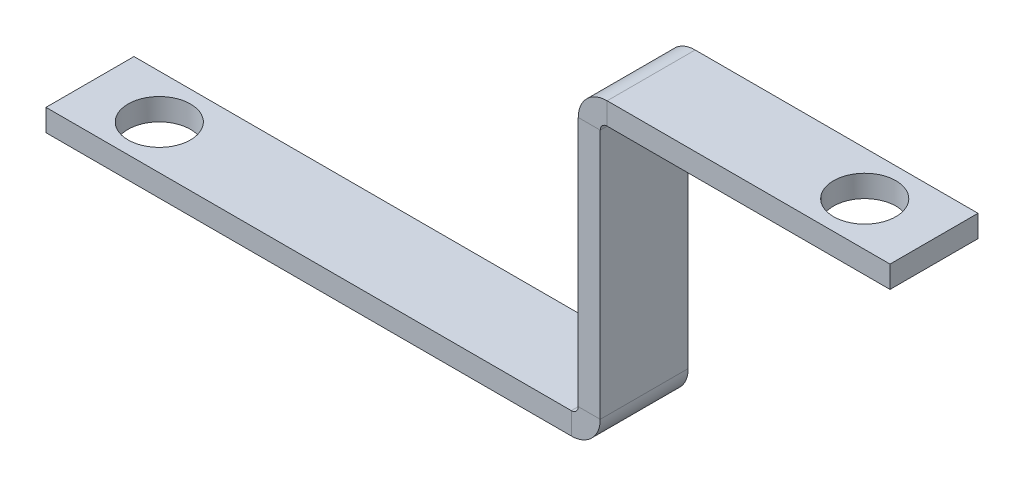
ISO-10303-21;
HEADER;
FILE_DESCRIPTION(('STEP AP214'),'2;1');
FILE_NAME('part.step','',(''),(''),'','','');
FILE_SCHEMA(('AUTOMOTIVE_DESIGN { 1 0 10303 214 1 1 1 1 }'));
ENDSEC;
DATA;
#1=APPLICATION_CONTEXT('core data for automotive mechanical design processes');
#2=APPLICATION_PROTOCOL_DEFINITION('international standard','automotive_design',2000,#1);
#3=PRODUCT_CONTEXT('',#1,'mechanical');
#4=PRODUCT('Part','Part','',(#3));
#5=PRODUCT_RELATED_PRODUCT_CATEGORY('part','',(#4));
#6=PRODUCT_DEFINITION_FORMATION('','',#4);
#7=PRODUCT_DEFINITION_CONTEXT('part definition',#1,'design');
#8=PRODUCT_DEFINITION('design','',#6,#7);
#9=PRODUCT_DEFINITION_SHAPE('','',#8);
#10=(LENGTH_UNIT() NAMED_UNIT(*) SI_UNIT(.MILLI.,.METRE.));
#11=(NAMED_UNIT(*) PLANE_ANGLE_UNIT() SI_UNIT($,.RADIAN.));
#12=(NAMED_UNIT(*) SI_UNIT($,.STERADIAN.) SOLID_ANGLE_UNIT());
#13=UNCERTAINTY_MEASURE_WITH_UNIT(LENGTH_MEASURE(1.E-05),#10,'distance_accuracy_value','');
#14=(GEOMETRIC_REPRESENTATION_CONTEXT(3) GLOBAL_UNCERTAINTY_ASSIGNED_CONTEXT((#13)) GLOBAL_UNIT_ASSIGNED_CONTEXT((#10,
#11,#12)) REPRESENTATION_CONTEXT('',''));
#15=CARTESIAN_POINT('',(0.,0.,0.));
#16=DIRECTION('',(0.,0.,1.));
#17=DIRECTION('',(1.,0.,0.));
#18=AXIS2_PLACEMENT_3D('',#15,#16,#17);
#19=CARTESIAN_POINT('',(80.,3.17499999999999,0.));
#20=DIRECTION('',(0.,0.,-1.));
#21=DIRECTION('',(-1.,0.,0.));
#22=AXIS2_PLACEMENT_3D('',#19,#20,#21);
#23=PLANE('',#22);
#24=DIRECTION('',(-1.,0.,0.));
#25=VECTOR('',#24,1.);
#26=CARTESIAN_POINT('',(80.0000000000001,40.32,0.));
#27=LINE('',#26,#25);
#28=CARTESIAN_POINT('',(80.0000000000001,40.32,0.));
#29=VERTEX_POINT('',#28);
#30=CARTESIAN_POINT('',(76.8250000000001,40.32,0.));
#31=VERTEX_POINT('',#30);
#32=EDGE_CURVE('E219',#29,#31,#27,.T.);
#33=ORIENTED_EDGE('',*,*,#32,.T.);
#34=DIRECTION('',(0.,1.,0.));
#35=VECTOR('',#34,1.);
#36=CARTESIAN_POINT('',(76.825,3.175,0.));
#37=LINE('',#36,#35);
#38=CARTESIAN_POINT('',(76.825,4.175,0.));
#39=VERTEX_POINT('',#38);
#40=EDGE_CURVE('E244',#31,#39,#37,.F.);
#41=ORIENTED_EDGE('',*,*,#40,.T.);
#42=DIRECTION('',(-1.,0.,0.));
#43=VECTOR('',#42,1.);
#44=CARTESIAN_POINT('',(80.,4.17499999999999,0.));
#45=LINE('',#44,#43);
#46=CARTESIAN_POINT('',(80.,4.17499999999999,0.));
#47=VERTEX_POINT('',#46);
#48=EDGE_CURVE('E232',#39,#47,#45,.F.);
#49=ORIENTED_EDGE('',*,*,#48,.T.);
#50=DIRECTION('',(0.,-1.,0.));
#51=VECTOR('',#50,1.);
#52=CARTESIAN_POINT('',(80.,-2.79774471795153E-13,0.));
#53=LINE('',#52,#51);
#54=EDGE_CURVE('E239',#29,#47,#53,.T.);
#55=ORIENTED_EDGE('',*,*,#54,.F.);
#56=EDGE_LOOP('',(#33,#41,#49,#55));
#57=FACE_BOUND('',#56,.T.);
#58=ADVANCED_FACE('F81',(#57),#23,.F.);
#59=CARTESIAN_POINT('',(80.0000000000001,44.495,-12.7));
#60=DIRECTION('',(0.,0.,1.));
#61=DIRECTION('',(1.,0.,0.));
#62=AXIS2_PLACEMENT_3D('',#59,#60,#61);
#63=PLANE('',#62);
#64=DIRECTION('',(-1.,0.,0.));
#65=VECTOR('',#64,1.);
#66=CARTESIAN_POINT('',(80.0000000000001,40.32,-12.7));
#67=LINE('',#66,#65);
#68=CARTESIAN_POINT('',(80.0000000000001,40.32,-12.7));
#69=VERTEX_POINT('',#68);
#70=CARTESIAN_POINT('',(76.8250000000001,40.32,-12.7));
#71=VERTEX_POINT('',#70);
#72=EDGE_CURVE('E230',#69,#71,#67,.T.);
#73=ORIENTED_EDGE('',*,*,#72,.F.);
#74=DIRECTION('',(0.,1.,0.));
#75=VECTOR('',#74,1.);
#76=CARTESIAN_POINT('',(80.,-2.79774471795153E-13,-12.7));
#77=LINE('',#76,#75);
#78=CARTESIAN_POINT('',(80.,4.17499999999999,-12.7));
#79=VERTEX_POINT('',#78);
#80=EDGE_CURVE('E235',#79,#69,#77,.T.);
#81=ORIENTED_EDGE('',*,*,#80,.F.);
#82=DIRECTION('',(-1.,0.,0.));
#83=VECTOR('',#82,1.);
#84=CARTESIAN_POINT('',(76.825,4.175,-12.7));
#85=LINE('',#84,#83);
#86=CARTESIAN_POINT('',(76.825,4.175,-12.7));
#87=VERTEX_POINT('',#86);
#88=EDGE_CURVE('E248',#87,#79,#85,.F.);
#89=ORIENTED_EDGE('',*,*,#88,.F.);
#90=DIRECTION('',(0.,-1.,0.));
#91=VECTOR('',#90,1.);
#92=CARTESIAN_POINT('',(76.8250000000001,44.495,-12.7));
#93=LINE('',#92,#91);
#94=EDGE_CURVE('E241',#87,#71,#93,.F.);
#95=ORIENTED_EDGE('',*,*,#94,.T.);
#96=EDGE_LOOP('',(#73,#81,#89,#95));
#97=FACE_BOUND('',#96,.T.);
#98=ADVANCED_FACE('F328',(#97),#63,.F.);
#99=CARTESIAN_POINT('',(80.,-2.79774471795153E-13,0.));
#100=DIRECTION('',(-1.,0.,0.));
#101=DIRECTION('',(0.,-1.,0.));
#102=AXIS2_PLACEMENT_3D('',#99,#100,#101);
#103=PLANE('',#102);
#104=DIRECTION('',(0.,0.,1.));
#105=VECTOR('',#104,1.);
#106=CARTESIAN_POINT('',(80.0000000000001,40.32,0.));
#107=LINE('',#106,#105);
#108=EDGE_CURVE('E225',#29,#69,#107,.F.);
#109=ORIENTED_EDGE('',*,*,#108,.F.);
#110=ORIENTED_EDGE('',*,*,#54,.T.);
#111=DIRECTION('',(0.,0.,-1.));
#112=VECTOR('',#111,1.);
#113=CARTESIAN_POINT('',(80.,4.17499999999999,0.));
#114=LINE('',#113,#112);
#115=EDGE_CURVE('E246',#79,#47,#114,.F.);
#116=ORIENTED_EDGE('',*,*,#115,.F.);
#117=ORIENTED_EDGE('',*,*,#80,.T.);
#118=EDGE_LOOP('',(#109,#110,#116,#117));
#119=FACE_BOUND('',#118,.T.);
#120=ADVANCED_FACE('F334',(#119),#103,.F.);
#121=CARTESIAN_POINT('',(76.825,-2.68689018544326E-13,0.));
#122=DIRECTION('',(-1.,0.,0.));
#123=DIRECTION('',(0.,-1.,0.));
#124=AXIS2_PLACEMENT_3D('',#121,#122,#123);
#125=PLANE('',#124);
#126=ORIENTED_EDGE('',*,*,#40,.F.);
#127=DIRECTION('',(0.,0.,1.));
#128=VECTOR('',#127,1.);
#129=CARTESIAN_POINT('',(76.8250000000001,40.32,0.));
#130=LINE('',#129,#128);
#131=EDGE_CURVE('E214',#31,#71,#130,.F.);
#132=ORIENTED_EDGE('',*,*,#131,.T.);
#133=ORIENTED_EDGE('',*,*,#94,.F.);
#134=DIRECTION('',(0.,0.,-1.));
#135=VECTOR('',#134,1.);
#136=CARTESIAN_POINT('',(76.825,4.175,0.));
#137=LINE('',#136,#135);
#138=EDGE_CURVE('E251',#39,#87,#137,.T.);
#139=ORIENTED_EDGE('',*,*,#138,.F.);
#140=EDGE_LOOP('',(#126,#132,#133,#139));
#141=FACE_BOUND('',#140,.T.);
#142=ADVANCED_FACE('F324',(#141),#125,.T.);
#143=CARTESIAN_POINT('',(0.,3.175,-12.7));
#144=DIRECTION('',(0.,0.,1.));
#145=DIRECTION('',(-1.,0.,0.));
#146=AXIS2_PLACEMENT_3D('',#143,#144,#145);
#147=PLANE('',#146);
#148=DIRECTION('',(-1.,0.,0.));
#149=VECTOR('',#148,1.);
#150=CARTESIAN_POINT('',(0.,3.175,-12.7));
#151=LINE('',#150,#149);
#152=CARTESIAN_POINT('',(75.825,3.175,-12.7));
#153=VERTEX_POINT('',#152);
#154=CARTESIAN_POINT('',(0.,3.175,-12.7));
#155=VERTEX_POINT('',#154);
#156=EDGE_CURVE('E282',#153,#155,#151,.T.);
#157=ORIENTED_EDGE('',*,*,#156,.F.);
#158=DIRECTION('',(0.,-1.,0.));
#159=VECTOR('',#158,1.);
#160=CARTESIAN_POINT('',(75.825,3.175,-12.7));
#161=LINE('',#160,#159);
#162=CARTESIAN_POINT('',(75.825,0.,-12.7));
#163=VERTEX_POINT('',#162);
#164=EDGE_CURVE('E260',#153,#163,#161,.T.);
#165=ORIENTED_EDGE('',*,*,#164,.T.);
#166=DIRECTION('',(1.,0.,0.));
#167=VECTOR('',#166,1.);
#168=CARTESIAN_POINT('',(0.,0.,-12.7));
#169=LINE('',#168,#167);
#170=CARTESIAN_POINT('',(0.,0.,-12.7));
#171=VERTEX_POINT('',#170);
#172=EDGE_CURVE('E279',#163,#171,#169,.F.);
#173=ORIENTED_EDGE('',*,*,#172,.T.);
#174=DIRECTION('',(0.,1.,0.));
#175=VECTOR('',#174,1.);
#176=CARTESIAN_POINT('',(0.,3.175,-12.7));
#177=LINE('',#176,#175);
#178=EDGE_CURVE('E13',#171,#155,#177,.T.);
#179=ORIENTED_EDGE('',*,*,#178,.T.);
#180=EDGE_LOOP('',(#157,#165,#173,#179));
#181=FACE_BOUND('',#180,.T.);
#182=ADVANCED_FACE('F303',(#181),#147,.F.);
#183=CARTESIAN_POINT('',(0.,3.175,0.));
#184=DIRECTION('',(0.,-1.,0.));
#185=DIRECTION('',(0.,0.,-1.));
#186=AXIS2_PLACEMENT_3D('',#183,#184,#185);
#187=PLANE('',#186);
#188=CARTESIAN_POINT('',(9.99999999999999,3.175,-6.35));
#189=DIRECTION('',(0.,-1.,0.));
#190=DIRECTION('',(0.,0.,-1.));
#191=AXIS2_PLACEMENT_3D('',#188,#189,#190);
#192=CIRCLE('',#191,4.49999999999999);
#193=CARTESIAN_POINT('',(9.99999999999999,3.175,-10.85));
#194=VERTEX_POINT('',#193);
#195=EDGE_CURVE('E213',#194,#194,#192,.T.);
#196=ORIENTED_EDGE('',*,*,#195,.T.);
#197=EDGE_LOOP('',(#196));
#198=FACE_BOUND('',#197,.T.);
#199=DIRECTION('',(0.,0.,-1.));
#200=VECTOR('',#199,1.);
#201=CARTESIAN_POINT('',(75.825,3.175,-12.7));
#202=LINE('',#201,#200);
#203=CARTESIAN_POINT('',(75.825,3.175,0.));
#204=VERTEX_POINT('',#203);
#205=EDGE_CURVE('E266',#153,#204,#202,.F.);
#206=ORIENTED_EDGE('',*,*,#205,.F.);
#207=ORIENTED_EDGE('',*,*,#156,.T.);
#208=DIRECTION('',(0.,0.,1.));
#209=VECTOR('',#208,1.);
#210=CARTESIAN_POINT('',(0.,3.175,0.));
#211=LINE('',#210,#209);
#212=CARTESIAN_POINT('',(0.,3.175,0.));
#213=VERTEX_POINT('',#212);
#214=EDGE_CURVE('E275',#155,#213,#211,.T.);
#215=ORIENTED_EDGE('',*,*,#214,.T.);
#216=DIRECTION('',(1.,0.,0.));
#217=VECTOR('',#216,1.);
#218=CARTESIAN_POINT('',(0.,3.175,0.));
#219=LINE('',#218,#217);
#220=EDGE_CURVE('E278',#213,#204,#219,.T.);
#221=ORIENTED_EDGE('',*,*,#220,.T.);
#222=EDGE_LOOP('',(#206,#207,#215,#221));
#223=FACE_BOUND('',#222,.T.);
#224=ADVANCED_FACE('F314',(#198,#223),#187,.F.);
#225=CARTESIAN_POINT('',(0.,0.,0.));
#226=DIRECTION('',(0.,-1.,0.));
#227=DIRECTION('',(0.,0.,-1.));
#228=AXIS2_PLACEMENT_3D('',#225,#226,#227);
#229=PLANE('',#228);
#230=CARTESIAN_POINT('',(9.99999999999999,0.,-6.35));
#231=DIRECTION('',(0.,1.,0.));
#232=DIRECTION('',(0.,0.,1.));
#233=AXIS2_PLACEMENT_3D('',#230,#231,#232);
#234=CIRCLE('',#233,4.49999999999999);
#235=CARTESIAN_POINT('',(9.99999999999999,0.,-1.85000000000001));
#236=VERTEX_POINT('',#235);
#237=EDGE_CURVE('E603',#236,#236,#234,.T.);
#238=ORIENTED_EDGE('',*,*,#237,.T.);
#239=EDGE_LOOP('',(#238));
#240=FACE_BOUND('',#239,.T.);
#241=ORIENTED_EDGE('',*,*,#172,.F.);
#242=DIRECTION('',(0.,0.,-1.));
#243=VECTOR('',#242,1.);
#244=CARTESIAN_POINT('',(75.825,0.,-12.7));
#245=LINE('',#244,#243);
#246=CARTESIAN_POINT('',(75.825,0.,0.));
#247=VERTEX_POINT('',#246);
#248=EDGE_CURVE('E255',#163,#247,#245,.F.);
#249=ORIENTED_EDGE('',*,*,#248,.T.);
#250=DIRECTION('',(1.,0.,0.));
#251=VECTOR('',#250,1.);
#252=CARTESIAN_POINT('',(0.,0.,0.));
#253=LINE('',#252,#251);
#254=CARTESIAN_POINT('',(0.,0.,0.));
#255=VERTEX_POINT('',#254);
#256=EDGE_CURVE('E286',#255,#247,#253,.T.);
#257=ORIENTED_EDGE('',*,*,#256,.F.);
#258=DIRECTION('',(0.,0.,-1.));
#259=VECTOR('',#258,1.);
#260=CARTESIAN_POINT('',(0.,0.,0.));
#261=LINE('',#260,#259);
#262=EDGE_CURVE('E272',#171,#255,#261,.F.);
#263=ORIENTED_EDGE('',*,*,#262,.F.);
#264=EDGE_LOOP('',(#241,#249,#257,#263));
#265=FACE_BOUND('',#264,.T.);
#266=ADVANCED_FACE('F296',(#240,#265),#229,.T.);
#267=CARTESIAN_POINT('',(0.,3.175,0.));
#268=DIRECTION('',(1.,0.,0.));
#269=DIRECTION('',(0.,0.,1.));
#270=AXIS2_PLACEMENT_3D('',#267,#268,#269);
#271=PLANE('',#270);
#272=ORIENTED_EDGE('',*,*,#178,.F.);
#273=ORIENTED_EDGE('',*,*,#262,.T.);
#274=DIRECTION('',(0.,1.,0.));
#275=VECTOR('',#274,1.);
#276=CARTESIAN_POINT('',(0.,3.175,0.));
#277=LINE('',#276,#275);
#278=EDGE_CURVE('E85',#255,#213,#277,.T.);
#279=ORIENTED_EDGE('',*,*,#278,.T.);
#280=ORIENTED_EDGE('',*,*,#214,.F.);
#281=EDGE_LOOP('',(#272,#273,#279,#280));
#282=FACE_BOUND('',#281,.T.);
#283=ADVANCED_FACE('F299',(#282),#271,.F.);
#284=CARTESIAN_POINT('',(0.,3.175,0.));
#285=DIRECTION('',(0.,0.,-1.));
#286=DIRECTION('',(1.,0.,0.));
#287=AXIS2_PLACEMENT_3D('',#284,#285,#286);
#288=PLANE('',#287);
#289=DIRECTION('',(0.,-1.,0.));
#290=VECTOR('',#289,1.);
#291=CARTESIAN_POINT('',(75.825,3.175,0.));
#292=LINE('',#291,#290);
#293=EDGE_CURVE('E270',#204,#247,#292,.T.);
#294=ORIENTED_EDGE('',*,*,#293,.F.);
#295=ORIENTED_EDGE('',*,*,#220,.F.);
#296=ORIENTED_EDGE('',*,*,#278,.F.);
#297=ORIENTED_EDGE('',*,*,#256,.T.);
#298=EDGE_LOOP('',(#294,#295,#296,#297));
#299=FACE_BOUND('',#298,.T.);
#300=ADVANCED_FACE('F83',(#299),#288,.F.);
#301=CARTESIAN_POINT('',(75.825,4.175,0.));
#302=DIRECTION('',(0.,0.,1.));
#303=DIRECTION('',(1.,0.,0.));
#304=AXIS2_PLACEMENT_3D('',#301,#302,#303);
#305=PLANE('',#304);
#306=ORIENTED_EDGE('',*,*,#48,.F.);
#307=CARTESIAN_POINT('',(75.825,4.175,0.));
#308=DIRECTION('',(0.,0.,-1.));
#309=DIRECTION('',(-1.,0.,0.));
#310=AXIS2_PLACEMENT_3D('',#307,#308,#309);
#311=CIRCLE('',#310,1.);
#312=EDGE_CURVE('E263',#204,#39,#311,.F.);
#313=ORIENTED_EDGE('',*,*,#312,.F.);
#314=ORIENTED_EDGE('',*,*,#293,.T.);
#315=CARTESIAN_POINT('',(75.825,4.175,0.));
#316=DIRECTION('',(0.,0.,-1.));
#317=DIRECTION('',(-1.,0.,0.));
#318=AXIS2_PLACEMENT_3D('',#315,#316,#317);
#319=CIRCLE('',#318,4.175);
#320=EDGE_CURVE('E104',#247,#47,#319,.F.);
#321=ORIENTED_EDGE('',*,*,#320,.T.);
#322=EDGE_LOOP('',(#306,#313,#314,#321));
#323=FACE_BOUND('',#322,.T.);
#324=ADVANCED_FACE('F345',(#323),#305,.T.);
#325=CARTESIAN_POINT('',(75.825,4.175,-12.7));
#326=DIRECTION('',(0.,0.,1.));
#327=DIRECTION('',(1.,0.,0.));
#328=AXIS2_PLACEMENT_3D('',#325,#326,#327);
#329=PLANE('',#328);
#330=CARTESIAN_POINT('',(75.825,4.175,-12.7));
#331=DIRECTION('',(0.,0.,-1.));
#332=DIRECTION('',(-1.,0.,0.));
#333=AXIS2_PLACEMENT_3D('',#330,#331,#332);
#334=CIRCLE('',#333,1.);
#335=EDGE_CURVE('E238',#87,#153,#334,.T.);
#336=ORIENTED_EDGE('',*,*,#335,.F.);
#337=ORIENTED_EDGE('',*,*,#88,.T.);
#338=CARTESIAN_POINT('',(75.825,4.175,-12.7));
#339=DIRECTION('',(0.,0.,-1.));
#340=DIRECTION('',(-1.,0.,0.));
#341=AXIS2_PLACEMENT_3D('',#338,#339,#340);
#342=CIRCLE('',#341,4.175);
#343=EDGE_CURVE('E258',#79,#163,#342,.T.);
#344=ORIENTED_EDGE('',*,*,#343,.T.);
#345=ORIENTED_EDGE('',*,*,#164,.F.);
#346=EDGE_LOOP('',(#336,#337,#344,#345));
#347=FACE_BOUND('',#346,.T.);
#348=ADVANCED_FACE('F306',(#347),#329,.F.);
#349=CARTESIAN_POINT('',(75.825,4.175,-12.7));
#350=DIRECTION('',(0.,0.,-1.));
#351=DIRECTION('',(1.,0.,0.));
#352=AXIS2_PLACEMENT_3D('',#349,#350,#351);
#353=CYLINDRICAL_SURFACE('',#352,4.175);
#354=ORIENTED_EDGE('',*,*,#248,.F.);
#355=ORIENTED_EDGE('',*,*,#343,.F.);
#356=ORIENTED_EDGE('',*,*,#115,.T.);
#357=ORIENTED_EDGE('',*,*,#320,.F.);
#358=EDGE_LOOP('',(#354,#355,#356,#357));
#359=FACE_BOUND('',#358,.T.);
#360=ADVANCED_FACE('F339',(#359),#353,.T.);
#361=CARTESIAN_POINT('',(75.825,4.175,-12.7));
#362=DIRECTION('',(0.,0.,-1.));
#363=DIRECTION('',(1.,0.,0.));
#364=AXIS2_PLACEMENT_3D('',#361,#362,#363);
#365=CYLINDRICAL_SURFACE('',#364,1.);
#366=ORIENTED_EDGE('',*,*,#205,.T.);
#367=ORIENTED_EDGE('',*,*,#312,.T.);
#368=ORIENTED_EDGE('',*,*,#138,.T.);
#369=ORIENTED_EDGE('',*,*,#335,.T.);
#370=EDGE_LOOP('',(#366,#367,#368,#369));
#371=FACE_BOUND('',#370,.T.);
#372=ADVANCED_FACE('F310',(#371),#365,.F.);
#373=CARTESIAN_POINT('',(81.0000000000001,40.32,-12.7));
#374=DIRECTION('',(0.,0.,-1.));
#375=DIRECTION('',(-1.,0.,0.));
#376=AXIS2_PLACEMENT_3D('',#373,#374,#375);
#377=PLANE('',#376);
#378=DIRECTION('',(0.,-1.,0.));
#379=VECTOR('',#378,1.);
#380=CARTESIAN_POINT('',(81.0000000000001,44.495,-12.7));
#381=LINE('',#380,#379);
#382=CARTESIAN_POINT('',(81.0000000000001,41.32,-12.7));
#383=VERTEX_POINT('',#382);
#384=CARTESIAN_POINT('',(81.0000000000001,44.495,-12.7));
#385=VERTEX_POINT('',#384);
#386=EDGE_CURVE('E195',#383,#385,#381,.F.);
#387=ORIENTED_EDGE('',*,*,#386,.F.);
#388=CARTESIAN_POINT('',(81.0000000000001,40.32,-12.7));
#389=DIRECTION('',(0.,0.,1.));
#390=DIRECTION('',(1.,0.,0.));
#391=AXIS2_PLACEMENT_3D('',#388,#389,#390);
#392=CIRCLE('',#391,1.);
#393=EDGE_CURVE('E222',#69,#383,#392,.F.);
#394=ORIENTED_EDGE('',*,*,#393,.F.);
#395=ORIENTED_EDGE('',*,*,#72,.T.);
#396=CARTESIAN_POINT('',(81.0000000000001,40.32,-12.7));
#397=DIRECTION('',(0.,0.,1.));
#398=DIRECTION('',(1.,0.,0.));
#399=AXIS2_PLACEMENT_3D('',#396,#397,#398);
#400=CIRCLE('',#399,4.175);
#401=EDGE_CURVE('E96',#71,#385,#400,.F.);
#402=ORIENTED_EDGE('',*,*,#401,.T.);
#403=EDGE_LOOP('',(#387,#394,#395,#402));
#404=FACE_BOUND('',#403,.T.);
#405=ADVANCED_FACE('F344',(#404),#377,.T.);
#406=CARTESIAN_POINT('',(81.0000000000001,40.32,0.));
#407=DIRECTION('',(0.,0.,-1.));
#408=DIRECTION('',(-1.,0.,0.));
#409=AXIS2_PLACEMENT_3D('',#406,#407,#408);
#410=PLANE('',#409);
#411=CARTESIAN_POINT('',(81.0000000000001,40.32,0.));
#412=DIRECTION('',(0.,0.,1.));
#413=DIRECTION('',(1.,0.,0.));
#414=AXIS2_PLACEMENT_3D('',#411,#412,#413);
#415=CIRCLE('',#414,1.);
#416=CARTESIAN_POINT('',(81.0000000000001,41.32,0.));
#417=VERTEX_POINT('',#416);
#418=EDGE_CURVE('E227',#417,#29,#415,.T.);
#419=ORIENTED_EDGE('',*,*,#418,.F.);
#420=DIRECTION('',(0.,-1.,0.));
#421=VECTOR('',#420,1.);
#422=CARTESIAN_POINT('',(81.0000000000001,41.32,0.));
#423=LINE('',#422,#421);
#424=CARTESIAN_POINT('',(81.0000000000001,44.495,0.));
#425=VERTEX_POINT('',#424);
#426=EDGE_CURVE('E207',#417,#425,#423,.F.);
#427=ORIENTED_EDGE('',*,*,#426,.T.);
#428=CARTESIAN_POINT('',(81.0000000000001,40.32,0.));
#429=DIRECTION('',(0.,0.,1.));
#430=DIRECTION('',(1.,0.,0.));
#431=AXIS2_PLACEMENT_3D('',#428,#429,#430);
#432=CIRCLE('',#431,4.175);
#433=EDGE_CURVE('E217',#425,#31,#432,.T.);
#434=ORIENTED_EDGE('',*,*,#433,.T.);
#435=ORIENTED_EDGE('',*,*,#32,.F.);
#436=EDGE_LOOP('',(#419,#427,#434,#435));
#437=FACE_BOUND('',#436,.T.);
#438=ADVANCED_FACE('F368',(#437),#410,.F.);
#439=CARTESIAN_POINT('',(81.0000000000001,40.32,0.));
#440=DIRECTION('',(0.,0.,1.));
#441=DIRECTION('',(0.,1.,0.));
#442=AXIS2_PLACEMENT_3D('',#439,#440,#441);
#443=CYLINDRICAL_SURFACE('',#442,4.175);
#444=ORIENTED_EDGE('',*,*,#131,.F.);
#445=ORIENTED_EDGE('',*,*,#433,.F.);
#446=DIRECTION('',(0.,0.,1.));
#447=VECTOR('',#446,1.);
#448=CARTESIAN_POINT('',(81.0000000000001,44.495,-12.7));
#449=LINE('',#448,#447);
#450=EDGE_CURVE('E205',#425,#385,#449,.F.);
#451=ORIENTED_EDGE('',*,*,#450,.T.);
#452=ORIENTED_EDGE('',*,*,#401,.F.);
#453=EDGE_LOOP('',(#444,#445,#451,#452));
#454=FACE_BOUND('',#453,.T.);
#455=ADVANCED_FACE('F377',(#454),#443,.T.);
#456=CARTESIAN_POINT('',(81.0000000000001,40.32,0.));
#457=DIRECTION('',(0.,0.,1.));
#458=DIRECTION('',(0.,1.,0.));
#459=AXIS2_PLACEMENT_3D('',#456,#457,#458);
#460=CYLINDRICAL_SURFACE('',#459,1.);
#461=ORIENTED_EDGE('',*,*,#108,.T.);
#462=ORIENTED_EDGE('',*,*,#393,.T.);
#463=DIRECTION('',(0.,0.,1.));
#464=VECTOR('',#463,1.);
#465=CARTESIAN_POINT('',(81.0000000000001,41.32,-12.7));
#466=LINE('',#465,#464);
#467=EDGE_CURVE('E210',#383,#417,#466,.T.);
#468=ORIENTED_EDGE('',*,*,#467,.T.);
#469=ORIENTED_EDGE('',*,*,#418,.T.);
#470=EDGE_LOOP('',(#461,#462,#468,#469));
#471=FACE_BOUND('',#470,.T.);
#472=ADVANCED_FACE('F385',(#471),#460,.F.);
#473=CARTESIAN_POINT('',(121.825,44.495,0.));
#474=DIRECTION('',(0.,0.,-1.));
#475=DIRECTION('',(-1.,0.,0.));
#476=AXIS2_PLACEMENT_3D('',#473,#474,#475);
#477=PLANE('',#476);
#478=ORIENTED_EDGE('',*,*,#426,.F.);
#479=DIRECTION('',(-1.,0.,0.));
#480=VECTOR('',#479,1.);
#481=CARTESIAN_POINT('',(121.825,41.32,0.));
#482=LINE('',#481,#480);
#483=CARTESIAN_POINT('',(121.825,41.32,0.));
#484=VERTEX_POINT('',#483);
#485=EDGE_CURVE('E203',#417,#484,#482,.F.);
#486=ORIENTED_EDGE('',*,*,#485,.T.);
#487=DIRECTION('',(0.,-1.,0.));
#488=VECTOR('',#487,1.);
#489=CARTESIAN_POINT('',(121.825,44.495,0.));
#490=LINE('',#489,#488);
#491=CARTESIAN_POINT('',(121.825,44.495,0.));
#492=VERTEX_POINT('',#491);
#493=EDGE_CURVE('E191',#492,#484,#490,.T.);
#494=ORIENTED_EDGE('',*,*,#493,.F.);
#495=DIRECTION('',(1.,0.,0.));
#496=VECTOR('',#495,1.);
#497=CARTESIAN_POINT('',(0.,44.495,0.));
#498=LINE('',#497,#496);
#499=EDGE_CURVE('E178',#425,#492,#498,.T.);
#500=ORIENTED_EDGE('',*,*,#499,.F.);
#501=EDGE_LOOP('',(#478,#486,#494,#500));
#502=FACE_BOUND('',#501,.T.);
#503=ADVANCED_FACE('F392',(#502),#477,.F.);
#504=CARTESIAN_POINT('',(80.0000000000001,44.495,-12.7));
#505=DIRECTION('',(0.,0.,1.));
#506=DIRECTION('',(1.,0.,0.));
#507=AXIS2_PLACEMENT_3D('',#504,#505,#506);
#508=PLANE('',#507);
#509=ORIENTED_EDGE('',*,*,#386,.T.);
#510=DIRECTION('',(-1.,0.,0.));
#511=VECTOR('',#510,1.);
#512=CARTESIAN_POINT('',(0.,44.495,-12.7));
#513=LINE('',#512,#511);
#514=CARTESIAN_POINT('',(121.825,44.495,-12.7));
#515=VERTEX_POINT('',#514);
#516=EDGE_CURVE('E176',#515,#385,#513,.T.);
#517=ORIENTED_EDGE('',*,*,#516,.F.);
#518=DIRECTION('',(0.,-1.,0.));
#519=VECTOR('',#518,1.);
#520=CARTESIAN_POINT('',(121.825,44.495,-12.7));
#521=LINE('',#520,#519);
#522=CARTESIAN_POINT('',(121.825,41.32,-12.7));
#523=VERTEX_POINT('',#522);
#524=EDGE_CURVE('E184',#515,#523,#521,.T.);
#525=ORIENTED_EDGE('',*,*,#524,.T.);
#526=DIRECTION('',(1.,0.,0.));
#527=VECTOR('',#526,1.);
#528=CARTESIAN_POINT('',(80.0000000000001,41.32,-12.7));
#529=LINE('',#528,#527);
#530=EDGE_CURVE('E200',#523,#383,#529,.F.);
#531=ORIENTED_EDGE('',*,*,#530,.T.);
#532=EDGE_LOOP('',(#509,#517,#525,#531));
#533=FACE_BOUND('',#532,.T.);
#534=ADVANCED_FACE('F194',(#533),#508,.F.);
#535=CARTESIAN_POINT('',(0.,44.495,0.));
#536=DIRECTION('',(0.,-1.,0.));
#537=DIRECTION('',(1.,0.,0.));
#538=AXIS2_PLACEMENT_3D('',#535,#536,#537);
#539=PLANE('',#538);
#540=CARTESIAN_POINT('',(111.825,44.495,-6.35));
#541=DIRECTION('',(0.,1.,0.));
#542=DIRECTION('',(0.,0.,1.));
#543=AXIS2_PLACEMENT_3D('',#540,#541,#542);
#544=CIRCLE('',#543,4.49999999999999);
#545=CARTESIAN_POINT('',(111.825,44.495,-1.85000000000001));
#546=VERTEX_POINT('',#545);
#547=EDGE_CURVE('E609',#546,#546,#544,.T.);
#548=ORIENTED_EDGE('',*,*,#547,.F.);
#549=EDGE_LOOP('',(#548));
#550=FACE_BOUND('',#549,.T.);
#551=ORIENTED_EDGE('',*,*,#450,.F.);
#552=ORIENTED_EDGE('',*,*,#499,.T.);
#553=DIRECTION('',(0.,0.,-1.));
#554=VECTOR('',#553,1.);
#555=CARTESIAN_POINT('',(121.825,44.495,0.));
#556=LINE('',#555,#554);
#557=EDGE_CURVE('E171',#492,#515,#556,.T.);
#558=ORIENTED_EDGE('',*,*,#557,.T.);
#559=ORIENTED_EDGE('',*,*,#516,.T.);
#560=EDGE_LOOP('',(#551,#552,#558,#559));
#561=FACE_BOUND('',#560,.T.);
#562=ADVANCED_FACE('F174',(#550,#561),#539,.F.);
#563=CARTESIAN_POINT('',(0.,41.32,0.));
#564=DIRECTION('',(0.,-1.,0.));
#565=DIRECTION('',(1.,0.,0.));
#566=AXIS2_PLACEMENT_3D('',#563,#564,#565);
#567=PLANE('',#566);
#568=CARTESIAN_POINT('',(111.825,41.32,-6.35));
#569=DIRECTION('',(0.,-1.,0.));
#570=DIRECTION('',(1.,0.,0.));
#571=AXIS2_PLACEMENT_3D('',#568,#569,#570);
#572=CIRCLE('',#571,4.49999999999999);
#573=CARTESIAN_POINT('',(116.325,41.32,-6.35));
#574=VERTEX_POINT('',#573);
#575=EDGE_CURVE('E606',#574,#574,#572,.T.);
#576=ORIENTED_EDGE('',*,*,#575,.F.);
#577=EDGE_LOOP('',(#576));
#578=FACE_BOUND('',#577,.T.);
#579=ORIENTED_EDGE('',*,*,#485,.F.);
#580=ORIENTED_EDGE('',*,*,#467,.F.);
#581=ORIENTED_EDGE('',*,*,#530,.F.);
#582=DIRECTION('',(0.,0.,1.));
#583=VECTOR('',#582,1.);
#584=CARTESIAN_POINT('',(121.825,41.32,-12.7));
#585=LINE('',#584,#583);
#586=EDGE_CURVE('E187',#484,#523,#585,.F.);
#587=ORIENTED_EDGE('',*,*,#586,.F.);
#588=EDGE_LOOP('',(#579,#580,#581,#587));
#589=FACE_BOUND('',#588,.T.);
#590=ADVANCED_FACE('F414',(#578,#589),#567,.T.);
#591=CARTESIAN_POINT('',(121.825,44.495,-12.7));
#592=DIRECTION('',(-1.,0.,0.));
#593=DIRECTION('',(0.,-1.,0.));
#594=AXIS2_PLACEMENT_3D('',#591,#592,#593);
#595=PLANE('',#594);
#596=ORIENTED_EDGE('',*,*,#586,.T.);
#597=ORIENTED_EDGE('',*,*,#524,.F.);
#598=ORIENTED_EDGE('',*,*,#557,.F.);
#599=ORIENTED_EDGE('',*,*,#493,.T.);
#600=EDGE_LOOP('',(#596,#597,#598,#599));
#601=FACE_BOUND('',#600,.T.);
#602=ADVANCED_FACE('F185',(#601),#595,.F.);
#603=CARTESIAN_POINT('',(9.99999999999999,44.495,-6.35));
#604=DIRECTION('',(0.,1.,0.));
#605=DIRECTION('',(0.,0.,1.));
#606=AXIS2_PLACEMENT_3D('',#603,#604,#605);
#607=CYLINDRICAL_SURFACE('',#606,4.49999999999999);
#608=ORIENTED_EDGE('',*,*,#237,.F.);
#609=EDGE_LOOP('',(#608));
#610=FACE_BOUND('',#609,.T.);
#611=ORIENTED_EDGE('',*,*,#195,.F.);
#612=EDGE_LOOP('',(#611));
#613=FACE_BOUND('',#612,.T.);
#614=ADVANCED_FACE('F430',(#610,#613),#607,.F.);
#615=CARTESIAN_POINT('',(111.825,44.495,-6.35));
#616=DIRECTION('',(0.,1.,0.));
#617=DIRECTION('',(0.,0.,1.));
#618=AXIS2_PLACEMENT_3D('',#615,#616,#617);
#619=CYLINDRICAL_SURFACE('',#618,4.49999999999999);
#620=ORIENTED_EDGE('',*,*,#575,.T.);
#621=EDGE_LOOP('',(#620));
#622=FACE_BOUND('',#621,.T.);
#623=ORIENTED_EDGE('',*,*,#547,.T.);
#624=EDGE_LOOP('',(#623));
#625=FACE_BOUND('',#624,.T.);
#626=ADVANCED_FACE('F436',(#622,#625),#619,.F.);
#627=CLOSED_SHELL('',(#58,#98,#120,#142,#182,#224,#266,#283,#300,#324,#348,#360,#372,#405,#438,
#455,#472,#503,#534,#562,#590,#602,#614,#626));
#628=MANIFOLD_SOLID_BREP('B2',#627);
#629=ADVANCED_BREP_SHAPE_REPRESENTATION('',(#18,#628),#14);
#630=SHAPE_DEFINITION_REPRESENTATION(#9,#629);
ENDSEC;
END-ISO-10303-21;
